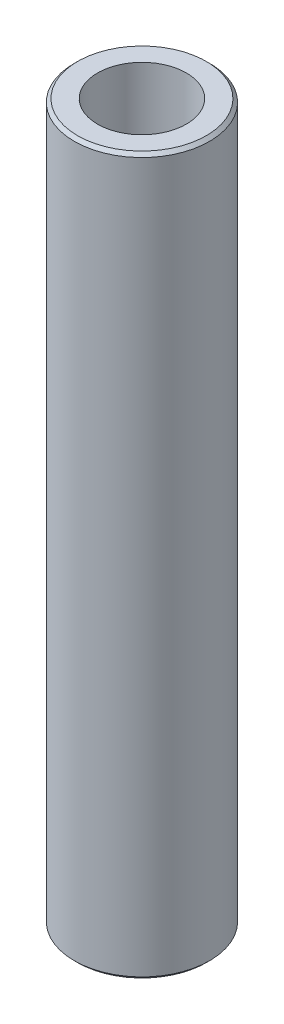
ISO-10303-21;
HEADER;
FILE_DESCRIPTION(('STEP AP214'),'2;1');
FILE_NAME('part.step','',(''),(''),'','','');
FILE_SCHEMA(('AUTOMOTIVE_DESIGN { 1 0 10303 214 1 1 1 1 }'));
ENDSEC;
DATA;
#1=APPLICATION_CONTEXT('core data for automotive mechanical design processes');
#2=APPLICATION_PROTOCOL_DEFINITION('international standard','automotive_design',2000,#1);
#3=PRODUCT_CONTEXT('',#1,'mechanical');
#4=PRODUCT('Part','Part','',(#3));
#5=PRODUCT_RELATED_PRODUCT_CATEGORY('part','',(#4));
#6=PRODUCT_DEFINITION_FORMATION('','',#4);
#7=PRODUCT_DEFINITION_CONTEXT('part definition',#1,'design');
#8=PRODUCT_DEFINITION('design','',#6,#7);
#9=PRODUCT_DEFINITION_SHAPE('','',#8);
#10=(LENGTH_UNIT() NAMED_UNIT(*) SI_UNIT(.MILLI.,.METRE.));
#11=(NAMED_UNIT(*) PLANE_ANGLE_UNIT() SI_UNIT($,.RADIAN.));
#12=(NAMED_UNIT(*) SI_UNIT($,.STERADIAN.) SOLID_ANGLE_UNIT());
#13=UNCERTAINTY_MEASURE_WITH_UNIT(LENGTH_MEASURE(1.E-05),#10,'distance_accuracy_value','');
#14=(GEOMETRIC_REPRESENTATION_CONTEXT(3) GLOBAL_UNCERTAINTY_ASSIGNED_CONTEXT((#13)) GLOBAL_UNIT_ASSIGNED_CONTEXT((#10,
#11,#12)) REPRESENTATION_CONTEXT('',''));
#15=CARTESIAN_POINT('',(0.,0.,0.));
#16=DIRECTION('',(0.,0.,1.));
#17=DIRECTION('',(1.,0.,0.));
#18=AXIS2_PLACEMENT_3D('',#15,#16,#17);
#19=CARTESIAN_POINT('',(0.,476.418045287336,0.));
#20=DIRECTION('',(0.,-1.,0.));
#21=DIRECTION('',(0.,0.,-1.));
#22=AXIS2_PLACEMENT_3D('',#19,#20,#21);
#23=CYLINDRICAL_SURFACE('',#22,45.);
#24=CARTESIAN_POINT('',(0.,474.229848911344,0.));
#25=DIRECTION('',(0.,1.,0.));
#26=DIRECTION('',(0.,0.,1.));
#27=AXIS2_PLACEMENT_3D('',#24,#25,#26);
#28=CIRCLE('',#27,45.);
#29=CARTESIAN_POINT('',(0.,474.229848911344,45.));
#30=VERTEX_POINT('',#29);
#31=EDGE_CURVE('E50',#30,#30,#28,.F.);
#32=ORIENTED_EDGE('',*,*,#31,.T.);
#33=EDGE_LOOP('',(#32));
#34=FACE_BOUND('',#33,.T.);
#35=CARTESIAN_POINT('',(0.,2.18819637599149,0.));
#36=DIRECTION('',(0.,1.,0.));
#37=DIRECTION('',(0.,0.,1.));
#38=AXIS2_PLACEMENT_3D('',#35,#36,#37);
#39=CIRCLE('',#38,45.);
#40=CARTESIAN_POINT('',(0.,2.18819637599149,45.));
#41=VERTEX_POINT('',#40);
#42=EDGE_CURVE('E51',#41,#41,#39,.T.);
#43=ORIENTED_EDGE('',*,*,#42,.T.);
#44=EDGE_LOOP('',(#43));
#45=FACE_BOUND('',#44,.T.);
#46=ADVANCED_FACE('F39',(#34,#45),#23,.T.);
#47=CARTESIAN_POINT('',(0.,476.418045287336,0.));
#48=DIRECTION('',(0.,1.,0.));
#49=DIRECTION('',(0.,0.,1.));
#50=AXIS2_PLACEMENT_3D('',#47,#48,#49);
#51=PLANE('',#50);
#52=CARTESIAN_POINT('',(0.,476.418045287336,0.));
#53=DIRECTION('',(0.,1.,0.));
#54=DIRECTION('',(0.,0.,1.));
#55=AXIS2_PLACEMENT_3D('',#52,#53,#54);
#56=CIRCLE('',#55,42.8118036240084);
#57=CARTESIAN_POINT('',(0.,476.418045287336,42.8118036240084));
#58=VERTEX_POINT('',#57);
#59=EDGE_CURVE('E54',#58,#58,#56,.T.);
#60=ORIENTED_EDGE('',*,*,#59,.T.);
#61=EDGE_LOOP('',(#60));
#62=FACE_BOUND('',#61,.T.);
#63=CARTESIAN_POINT('',(0.,476.418045287336,0.));
#64=DIRECTION('',(0.,1.,0.));
#65=DIRECTION('',(0.,0.,1.));
#66=AXIS2_PLACEMENT_3D('',#63,#64,#65);
#67=CIRCLE('',#66,29.5325384055498);
#68=CARTESIAN_POINT('',(0.,476.418045287336,29.5325384055498));
#69=VERTEX_POINT('',#68);
#70=EDGE_CURVE('E58',#69,#69,#67,.T.);
#71=ORIENTED_EDGE('',*,*,#70,.F.);
#72=EDGE_LOOP('',(#71));
#73=FACE_BOUND('',#72,.T.);
#74=ADVANCED_FACE('F69',(#62,#73),#51,.T.);
#75=CARTESIAN_POINT('',(0.,0.,0.));
#76=DIRECTION('',(0.,1.,0.));
#77=DIRECTION('',(0.,0.,1.));
#78=AXIS2_PLACEMENT_3D('',#75,#76,#77);
#79=PLANE('',#78);
#80=CARTESIAN_POINT('',(0.,0.,0.));
#81=DIRECTION('',(0.,1.,0.));
#82=DIRECTION('',(0.,0.,1.));
#83=AXIS2_PLACEMENT_3D('',#80,#81,#82);
#84=CIRCLE('',#83,42.8118036240085);
#85=CARTESIAN_POINT('',(0.,0.,42.8118036240085));
#86=VERTEX_POINT('',#85);
#87=EDGE_CURVE('E10',#86,#86,#84,.F.);
#88=ORIENTED_EDGE('',*,*,#87,.T.);
#89=EDGE_LOOP('',(#88));
#90=FACE_BOUND('',#89,.T.);
#91=CARTESIAN_POINT('',(0.,0.,0.));
#92=DIRECTION('',(0.,1.,0.));
#93=DIRECTION('',(0.,0.,1.));
#94=AXIS2_PLACEMENT_3D('',#91,#92,#93);
#95=CIRCLE('',#94,29.5325384055498);
#96=CARTESIAN_POINT('',(0.,0.,29.5325384055498));
#97=VERTEX_POINT('',#96);
#98=EDGE_CURVE('E63',#97,#97,#95,.T.);
#99=ORIENTED_EDGE('',*,*,#98,.T.);
#100=EDGE_LOOP('',(#99));
#101=FACE_BOUND('',#100,.T.);
#102=ADVANCED_FACE('F75',(#90,#101),#79,.F.);
#103=CARTESIAN_POINT('',(0.,476.418045287336,0.));
#104=DIRECTION('',(0.,-1.,0.));
#105=DIRECTION('',(0.,0.,-1.));
#106=AXIS2_PLACEMENT_3D('',#103,#104,#105);
#107=CYLINDRICAL_SURFACE('',#106,29.5325384055498);
#108=ORIENTED_EDGE('',*,*,#70,.T.);
#109=EDGE_LOOP('',(#108));
#110=FACE_BOUND('',#109,.T.);
#111=ORIENTED_EDGE('',*,*,#98,.F.);
#112=EDGE_LOOP('',(#111));
#113=FACE_BOUND('',#112,.T.);
#114=ADVANCED_FACE('F70',(#110,#113),#107,.F.);
#115=CARTESIAN_POINT('',(0.,476.418045287336,0.));
#116=DIRECTION('',(0.,-1.,0.));
#117=DIRECTION('',(0.,0.,-1.));
#118=AXIS2_PLACEMENT_3D('',#115,#116,#117);
#119=CONICAL_SURFACE('',#118,42.8118036240084,0.785398163397442);
#120=ORIENTED_EDGE('',*,*,#31,.F.);
#121=EDGE_LOOP('',(#120));
#122=FACE_BOUND('',#121,.T.);
#123=ORIENTED_EDGE('',*,*,#59,.F.);
#124=EDGE_LOOP('',(#123));
#125=FACE_BOUND('',#124,.T.);
#126=ADVANCED_FACE('F81',(#122,#125),#119,.T.);
#127=CARTESIAN_POINT('',(0.,2.18819637599149,0.));
#128=DIRECTION('',(0.,1.,0.));
#129=DIRECTION('',(0.,0.,1.));
#130=AXIS2_PLACEMENT_3D('',#127,#128,#129);
#131=CONICAL_SURFACE('',#130,45.,0.785398163397442);
#132=ORIENTED_EDGE('',*,*,#87,.F.);
#133=EDGE_LOOP('',(#132));
#134=FACE_BOUND('',#133,.T.);
#135=ORIENTED_EDGE('',*,*,#42,.F.);
#136=EDGE_LOOP('',(#135));
#137=FACE_BOUND('',#136,.T.);
#138=ADVANCED_FACE('F45',(#134,#137),#131,.T.);
#139=CLOSED_SHELL('',(#46,#74,#102,#114,#126,#138));
#140=MANIFOLD_SOLID_BREP('B2',#139);
#141=ADVANCED_BREP_SHAPE_REPRESENTATION('',(#18,#140),#14);
#142=SHAPE_DEFINITION_REPRESENTATION(#9,#141);
ENDSEC;
END-ISO-10303-21;
